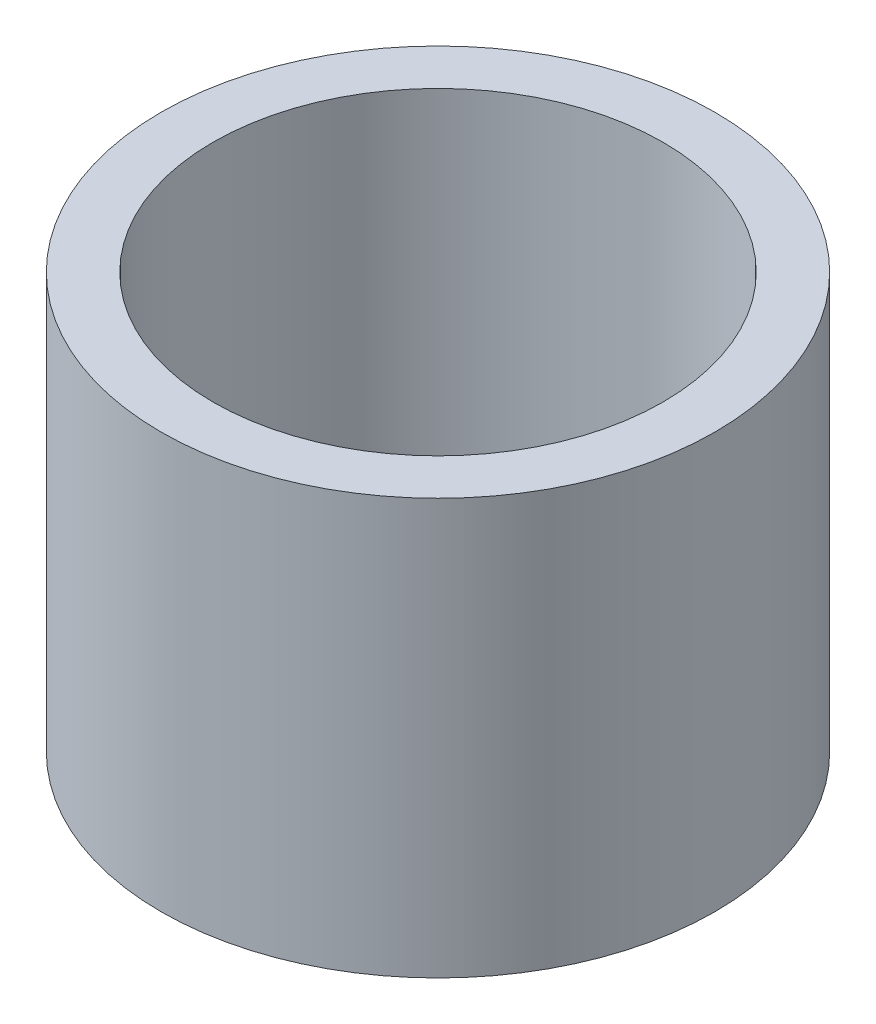
ISO-10303-21;
HEADER;
FILE_DESCRIPTION(('STEP AP214'),'2;1');
FILE_NAME('part.step','',(''),(''),'','','');
FILE_SCHEMA(('AUTOMOTIVE_DESIGN { 1 0 10303 214 1 1 1 1 }'));
ENDSEC;
DATA;
#1=APPLICATION_CONTEXT('core data for automotive mechanical design processes');
#2=APPLICATION_PROTOCOL_DEFINITION('international standard','automotive_design',2000,#1);
#3=PRODUCT_CONTEXT('',#1,'mechanical');
#4=PRODUCT('Part','Part','',(#3));
#5=PRODUCT_RELATED_PRODUCT_CATEGORY('part','',(#4));
#6=PRODUCT_DEFINITION_FORMATION('','',#4);
#7=PRODUCT_DEFINITION_CONTEXT('part definition',#1,'design');
#8=PRODUCT_DEFINITION('design','',#6,#7);
#9=PRODUCT_DEFINITION_SHAPE('','',#8);
#10=(LENGTH_UNIT() NAMED_UNIT(*) SI_UNIT(.MILLI.,.METRE.));
#11=(NAMED_UNIT(*) PLANE_ANGLE_UNIT() SI_UNIT($,.RADIAN.));
#12=(NAMED_UNIT(*) SI_UNIT($,.STERADIAN.) SOLID_ANGLE_UNIT());
#13=UNCERTAINTY_MEASURE_WITH_UNIT(LENGTH_MEASURE(1.E-05),#10,'distance_accuracy_value','');
#14=(GEOMETRIC_REPRESENTATION_CONTEXT(3) GLOBAL_UNCERTAINTY_ASSIGNED_CONTEXT((#13)) GLOBAL_UNIT_ASSIGNED_CONTEXT((#10,
#11,#12)) REPRESENTATION_CONTEXT('',''));
#15=CARTESIAN_POINT('',(0.,0.,0.));
#16=DIRECTION('',(0.,0.,1.));
#17=DIRECTION('',(1.,0.,0.));
#18=AXIS2_PLACEMENT_3D('',#15,#16,#17);
#19=CARTESIAN_POINT('',(3.49148336110938E-12,-1000.,0.));
#20=DIRECTION('',(0.,-1.,0.));
#21=DIRECTION('',(1.,0.,0.));
#22=AXIS2_PLACEMENT_3D('',#19,#20,#21);
#23=CYLINDRICAL_SURFACE('',#22,41.275);
#24=CARTESIAN_POINT('',(0.,-1.11022302462516E-13,0.));
#25=DIRECTION('',(0.,-1.,0.));
#26=DIRECTION('',(1.,0.,0.));
#27=AXIS2_PLACEMENT_3D('',#24,#25,#26);
#28=CIRCLE('',#27,41.2749999999999);
#29=CARTESIAN_POINT('',(41.2749999999999,0.,0.));
#30=VERTEX_POINT('',#29);
#31=EDGE_CURVE('E10',#30,#30,#28,.T.);
#32=ORIENTED_EDGE('',*,*,#31,.T.);
#33=EDGE_LOOP('',(#32));
#34=FACE_BOUND('',#33,.T.);
#35=CARTESIAN_POINT('',(-2.66051032116535E-13,76.1999999999998,0.));
#36=DIRECTION('',(0.,-1.,0.));
#37=DIRECTION('',(1.,0.,0.));
#38=AXIS2_PLACEMENT_3D('',#35,#36,#37);
#39=CIRCLE('',#38,41.2750000000001);
#40=CARTESIAN_POINT('',(41.2749999999999,76.2,0.));
#41=VERTEX_POINT('',#40);
#42=EDGE_CURVE('E45',#41,#41,#39,.T.);
#43=ORIENTED_EDGE('',*,*,#42,.F.);
#44=EDGE_LOOP('',(#43));
#45=FACE_BOUND('',#44,.T.);
#46=ADVANCED_FACE('F31',(#34,#45),#23,.F.);
#47=CARTESIAN_POINT('',(41.2749999999999,0.,0.));
#48=DIRECTION('',(0.,-1.,0.));
#49=DIRECTION('',(1.,0.,0.));
#50=AXIS2_PLACEMENT_3D('',#47,#48,#49);
#51=PLANE('',#50);
#52=CARTESIAN_POINT('',(0.,-2.22044604925031E-13,0.));
#53=DIRECTION('',(0.,-1.,0.));
#54=DIRECTION('',(1.,0.,0.));
#55=AXIS2_PLACEMENT_3D('',#52,#53,#54);
#56=CIRCLE('',#55,50.7999999999999);
#57=CARTESIAN_POINT('',(50.7999999999999,0.,0.));
#58=VERTEX_POINT('',#57);
#59=EDGE_CURVE('E37',#58,#58,#56,.T.);
#60=ORIENTED_EDGE('',*,*,#59,.T.);
#61=EDGE_LOOP('',(#60));
#62=FACE_BOUND('',#61,.T.);
#63=ORIENTED_EDGE('',*,*,#31,.F.);
#64=EDGE_LOOP('',(#63));
#65=FACE_BOUND('',#64,.T.);
#66=ADVANCED_FACE('F55',(#62,#65),#51,.T.);
#67=CARTESIAN_POINT('',(3.49148336110938E-12,-1000.,0.));
#68=DIRECTION('',(0.,-1.,0.));
#69=DIRECTION('',(1.,0.,0.));
#70=AXIS2_PLACEMENT_3D('',#67,#68,#69);
#71=CYLINDRICAL_SURFACE('',#70,50.8);
#72=CARTESIAN_POINT('',(-2.66051032116535E-13,76.1999999999998,0.));
#73=DIRECTION('',(0.,-1.,0.));
#74=DIRECTION('',(1.,0.,0.));
#75=AXIS2_PLACEMENT_3D('',#72,#73,#74);
#76=CIRCLE('',#75,50.8000000000001);
#77=CARTESIAN_POINT('',(50.7999999999999,76.2,0.));
#78=VERTEX_POINT('',#77);
#79=EDGE_CURVE('E41',#78,#78,#76,.T.);
#80=ORIENTED_EDGE('',*,*,#79,.T.);
#81=EDGE_LOOP('',(#80));
#82=FACE_BOUND('',#81,.T.);
#83=ORIENTED_EDGE('',*,*,#59,.F.);
#84=EDGE_LOOP('',(#83));
#85=FACE_BOUND('',#84,.T.);
#86=ADVANCED_FACE('F59',(#82,#85),#71,.T.);
#87=CARTESIAN_POINT('',(41.2749999999999,76.2,0.));
#88=DIRECTION('',(0.,1.,0.));
#89=DIRECTION('',(-1.,0.,0.));
#90=AXIS2_PLACEMENT_3D('',#87,#88,#89);
#91=PLANE('',#90);
#92=ORIENTED_EDGE('',*,*,#42,.T.);
#93=EDGE_LOOP('',(#92));
#94=FACE_BOUND('',#93,.T.);
#95=ORIENTED_EDGE('',*,*,#79,.F.);
#96=EDGE_LOOP('',(#95));
#97=FACE_BOUND('',#96,.T.);
#98=ADVANCED_FACE('F51',(#94,#97),#91,.T.);
#99=CLOSED_SHELL('',(#46,#66,#86,#98));
#100=MANIFOLD_SOLID_BREP('B2',#99);
#101=ADVANCED_BREP_SHAPE_REPRESENTATION('',(#18,#100),#14);
#102=SHAPE_DEFINITION_REPRESENTATION(#9,#101);
ENDSEC;
END-ISO-10303-21;
